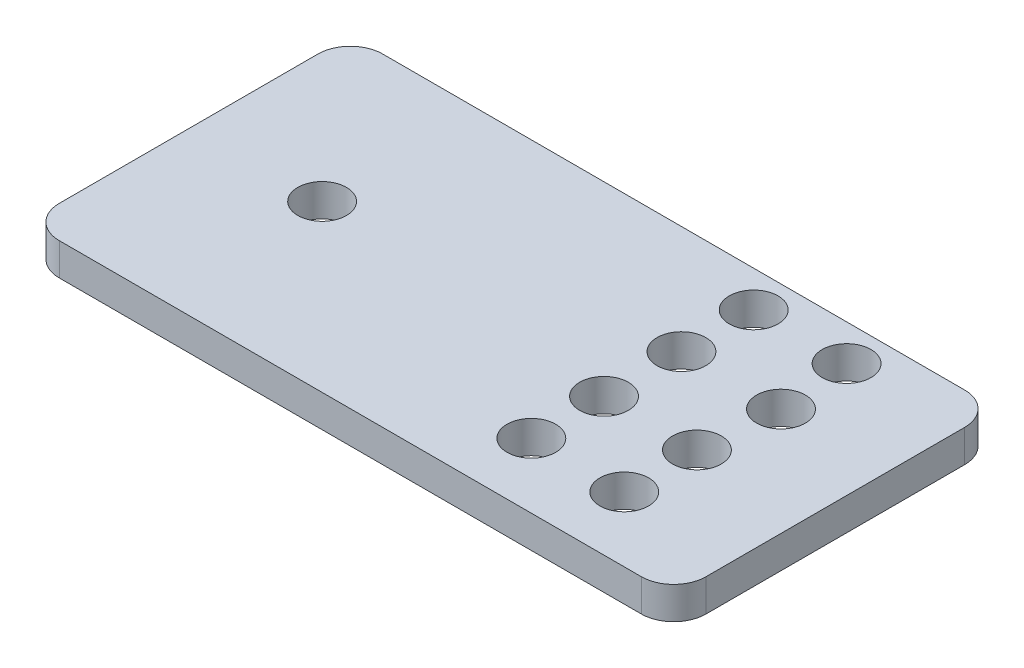
ISO-10303-21;
HEADER;
FILE_DESCRIPTION(('STEP AP214'),'2;1');
FILE_NAME('part.step','',(''),(''),'','','');
FILE_SCHEMA(('AUTOMOTIVE_DESIGN { 1 0 10303 214 1 1 1 1 }'));
ENDSEC;
DATA;
#1=APPLICATION_CONTEXT('core data for automotive mechanical design processes');
#2=APPLICATION_PROTOCOL_DEFINITION('international standard','automotive_design',2000,#1);
#3=PRODUCT_CONTEXT('',#1,'mechanical');
#4=PRODUCT('Part','Part','',(#3));
#5=PRODUCT_RELATED_PRODUCT_CATEGORY('part','',(#4));
#6=PRODUCT_DEFINITION_FORMATION('','',#4);
#7=PRODUCT_DEFINITION_CONTEXT('part definition',#1,'design');
#8=PRODUCT_DEFINITION('design','',#6,#7);
#9=PRODUCT_DEFINITION_SHAPE('','',#8);
#10=(LENGTH_UNIT() NAMED_UNIT(*) SI_UNIT(.MILLI.,.METRE.));
#11=(NAMED_UNIT(*) PLANE_ANGLE_UNIT() SI_UNIT($,.RADIAN.));
#12=(NAMED_UNIT(*) SI_UNIT($,.STERADIAN.) SOLID_ANGLE_UNIT());
#13=UNCERTAINTY_MEASURE_WITH_UNIT(LENGTH_MEASURE(1.E-05),#10,'distance_accuracy_value','');
#14=(GEOMETRIC_REPRESENTATION_CONTEXT(3) GLOBAL_UNCERTAINTY_ASSIGNED_CONTEXT((#13)) GLOBAL_UNIT_ASSIGNED_CONTEXT((#10,
#11,#12)) REPRESENTATION_CONTEXT('',''));
#15=CARTESIAN_POINT('',(0.,0.,0.));
#16=DIRECTION('',(0.,0.,1.));
#17=DIRECTION('',(1.,0.,0.));
#18=AXIS2_PLACEMENT_3D('',#15,#16,#17);
#19=CARTESIAN_POINT('',(73.5622211883193,10.,-38.8524590163934));
#20=DIRECTION('',(0.,-1.,0.));
#21=DIRECTION('',(0.,0.,-1.));
#22=AXIS2_PLACEMENT_3D('',#19,#20,#21);
#23=CYLINDRICAL_SURFACE('',#22,10.);
#24=CARTESIAN_POINT('',(73.5622211883193,0.,-38.8524590163934));
#25=DIRECTION('',(0.,1.,0.));
#26=DIRECTION('',(0.,0.,-1.));
#27=AXIS2_PLACEMENT_3D('',#24,#25,#26);
#28=CIRCLE('',#27,10.);
#29=CARTESIAN_POINT('',(83.5622211883193,0.,-38.8524590163934));
#30=VERTEX_POINT('',#29);
#31=CARTESIAN_POINT('',(73.5622211883193,0.,-48.8524590163935));
#32=VERTEX_POINT('',#31);
#33=EDGE_CURVE('E131',#30,#32,#28,.T.);
#34=ORIENTED_EDGE('',*,*,#33,.T.);
#35=DIRECTION('',(0.,-1.,0.));
#36=VECTOR('',#35,1.);
#37=CARTESIAN_POINT('',(73.5622211883193,10.,-48.8524590163935));
#38=LINE('',#37,#36);
#39=CARTESIAN_POINT('',(73.5622211883193,10.,-48.8524590163935));
#40=VERTEX_POINT('',#39);
#41=EDGE_CURVE('E11',#40,#32,#38,.T.);
#42=ORIENTED_EDGE('',*,*,#41,.F.);
#43=CARTESIAN_POINT('',(73.5622211883193,10.,-38.8524590163934));
#44=DIRECTION('',(0.,1.,0.));
#45=DIRECTION('',(0.,0.,-1.));
#46=AXIS2_PLACEMENT_3D('',#43,#44,#45);
#47=CIRCLE('',#46,10.);
#48=CARTESIAN_POINT('',(83.5622211883193,10.,-38.8524590163934));
#49=VERTEX_POINT('',#48);
#50=EDGE_CURVE('E146',#49,#40,#47,.T.);
#51=ORIENTED_EDGE('',*,*,#50,.F.);
#52=DIRECTION('',(0.,-1.,0.));
#53=VECTOR('',#52,1.);
#54=CARTESIAN_POINT('',(83.5622211883193,10.,-38.8524590163934));
#55=LINE('',#54,#53);
#56=EDGE_CURVE('E127',#49,#30,#55,.T.);
#57=ORIENTED_EDGE('',*,*,#56,.T.);
#58=EDGE_LOOP('',(#34,#42,#51,#57));
#59=FACE_BOUND('',#58,.T.);
#60=ADVANCED_FACE('F35',(#59),#23,.T.);
#61=CARTESIAN_POINT('',(73.5622211883193,10.,-48.8524590163935));
#62=DIRECTION('',(0.,0.,1.));
#63=DIRECTION('',(1.,0.,0.));
#64=AXIS2_PLACEMENT_3D('',#61,#62,#63);
#65=PLANE('',#64);
#66=DIRECTION('',(-1.,0.,0.));
#67=VECTOR('',#66,1.);
#68=CARTESIAN_POINT('',(73.5622211883193,0.,-48.8524590163935));
#69=LINE('',#68,#67);
#70=CARTESIAN_POINT('',(-106.437778811681,0.,-48.8524590163935));
#71=VERTEX_POINT('',#70);
#72=EDGE_CURVE('E134',#32,#71,#69,.T.);
#73=ORIENTED_EDGE('',*,*,#72,.T.);
#74=DIRECTION('',(0.,-1.,0.));
#75=VECTOR('',#74,1.);
#76=CARTESIAN_POINT('',(-106.437778811681,10.,-48.8524590163935));
#77=LINE('',#76,#75);
#78=CARTESIAN_POINT('',(-106.437778811681,10.,-48.8524590163935));
#79=VERTEX_POINT('',#78);
#80=EDGE_CURVE('E43',#79,#71,#77,.T.);
#81=ORIENTED_EDGE('',*,*,#80,.F.);
#82=DIRECTION('',(-1.,0.,0.));
#83=VECTOR('',#82,1.);
#84=CARTESIAN_POINT('',(73.5622211883193,10.,-48.8524590163935));
#85=LINE('',#84,#83);
#86=EDGE_CURVE('E94',#40,#79,#85,.T.);
#87=ORIENTED_EDGE('',*,*,#86,.F.);
#88=ORIENTED_EDGE('',*,*,#41,.T.);
#89=EDGE_LOOP('',(#73,#81,#87,#88));
#90=FACE_BOUND('',#89,.T.);
#91=ADVANCED_FACE('F264',(#90),#65,.F.);
#92=CARTESIAN_POINT('',(-106.437778811681,10.,-38.8524590163934));
#93=DIRECTION('',(0.,-1.,0.));
#94=DIRECTION('',(0.,0.,-1.));
#95=AXIS2_PLACEMENT_3D('',#92,#93,#94);
#96=CYLINDRICAL_SURFACE('',#95,10.);
#97=CARTESIAN_POINT('',(-106.437778811681,0.,-38.8524590163934));
#98=DIRECTION('',(0.,1.,0.));
#99=DIRECTION('',(0.,0.,1.));
#100=AXIS2_PLACEMENT_3D('',#97,#98,#99);
#101=CIRCLE('',#100,10.);
#102=CARTESIAN_POINT('',(-116.437778811681,0.,-38.8524590163934));
#103=VERTEX_POINT('',#102);
#104=EDGE_CURVE('E137',#71,#103,#101,.T.);
#105=ORIENTED_EDGE('',*,*,#104,.T.);
#106=DIRECTION('',(0.,-1.,0.));
#107=VECTOR('',#106,1.);
#108=CARTESIAN_POINT('',(-116.437778811681,10.,-38.8524590163934));
#109=LINE('',#108,#107);
#110=CARTESIAN_POINT('',(-116.437778811681,10.,-38.8524590163934));
#111=VERTEX_POINT('',#110);
#112=EDGE_CURVE('E153',#111,#103,#109,.T.);
#113=ORIENTED_EDGE('',*,*,#112,.F.);
#114=CARTESIAN_POINT('',(-106.437778811681,10.,-38.8524590163934));
#115=DIRECTION('',(0.,1.,0.));
#116=DIRECTION('',(0.,0.,1.));
#117=AXIS2_PLACEMENT_3D('',#114,#115,#116);
#118=CIRCLE('',#117,10.);
#119=EDGE_CURVE('E161',#79,#111,#118,.T.);
#120=ORIENTED_EDGE('',*,*,#119,.F.);
#121=ORIENTED_EDGE('',*,*,#80,.T.);
#122=EDGE_LOOP('',(#105,#113,#120,#121));
#123=FACE_BOUND('',#122,.T.);
#124=ADVANCED_FACE('F159',(#123),#96,.T.);
#125=CARTESIAN_POINT('',(-116.437778811681,10.,-38.8524590163934));
#126=DIRECTION('',(1.,0.,0.));
#127=DIRECTION('',(0.,0.,-1.));
#128=AXIS2_PLACEMENT_3D('',#125,#126,#127);
#129=PLANE('',#128);
#130=DIRECTION('',(0.,0.,1.));
#131=VECTOR('',#130,1.);
#132=CARTESIAN_POINT('',(-116.437778811681,0.,-38.8524590163934));
#133=LINE('',#132,#131);
#134=CARTESIAN_POINT('',(-116.437778811681,0.,41.1475409836065));
#135=VERTEX_POINT('',#134);
#136=EDGE_CURVE('E139',#103,#135,#133,.T.);
#137=ORIENTED_EDGE('',*,*,#136,.T.);
#138=DIRECTION('',(0.,-1.,0.));
#139=VECTOR('',#138,1.);
#140=CARTESIAN_POINT('',(-116.437778811681,10.,41.1475409836065));
#141=LINE('',#140,#139);
#142=CARTESIAN_POINT('',(-116.437778811681,10.,41.1475409836065));
#143=VERTEX_POINT('',#142);
#144=EDGE_CURVE('E150',#143,#135,#141,.T.);
#145=ORIENTED_EDGE('',*,*,#144,.F.);
#146=DIRECTION('',(0.,0.,1.));
#147=VECTOR('',#146,1.);
#148=CARTESIAN_POINT('',(-116.437778811681,10.,-38.8524590163934));
#149=LINE('',#148,#147);
#150=EDGE_CURVE('E173',#111,#143,#149,.T.);
#151=ORIENTED_EDGE('',*,*,#150,.F.);
#152=ORIENTED_EDGE('',*,*,#112,.T.);
#153=EDGE_LOOP('',(#137,#145,#151,#152));
#154=FACE_BOUND('',#153,.T.);
#155=ADVANCED_FACE('F169',(#154),#129,.F.);
#156=CARTESIAN_POINT('',(-106.437778811681,10.,41.1475409836066));
#157=DIRECTION('',(0.,-1.,0.));
#158=DIRECTION('',(0.,0.,-1.));
#159=AXIS2_PLACEMENT_3D('',#156,#157,#158);
#160=CYLINDRICAL_SURFACE('',#159,10.);
#161=CARTESIAN_POINT('',(-106.437778811681,0.,41.1475409836066));
#162=DIRECTION('',(0.,1.,0.));
#163=DIRECTION('',(0.,0.,1.));
#164=AXIS2_PLACEMENT_3D('',#161,#162,#163);
#165=CIRCLE('',#164,10.);
#166=CARTESIAN_POINT('',(-106.437778811681,0.,51.1475409836066));
#167=VERTEX_POINT('',#166);
#168=EDGE_CURVE('E141',#135,#167,#165,.T.);
#169=ORIENTED_EDGE('',*,*,#168,.T.);
#170=DIRECTION('',(0.,-1.,0.));
#171=VECTOR('',#170,1.);
#172=CARTESIAN_POINT('',(-106.437778811681,10.,51.1475409836066));
#173=LINE('',#172,#171);
#174=CARTESIAN_POINT('',(-106.437778811681,10.,51.1475409836066));
#175=VERTEX_POINT('',#174);
#176=EDGE_CURVE('E122',#175,#167,#173,.T.);
#177=ORIENTED_EDGE('',*,*,#176,.F.);
#178=CARTESIAN_POINT('',(-106.437778811681,10.,41.1475409836066));
#179=DIRECTION('',(0.,1.,0.));
#180=DIRECTION('',(0.,0.,1.));
#181=AXIS2_PLACEMENT_3D('',#178,#179,#180);
#182=CIRCLE('',#181,10.);
#183=EDGE_CURVE('E113',#143,#175,#182,.T.);
#184=ORIENTED_EDGE('',*,*,#183,.F.);
#185=ORIENTED_EDGE('',*,*,#144,.T.);
#186=EDGE_LOOP('',(#169,#177,#184,#185));
#187=FACE_BOUND('',#186,.T.);
#188=ADVANCED_FACE('F172',(#187),#160,.T.);
#189=CARTESIAN_POINT('',(73.5622211883193,10.,51.1475409836066));
#190=DIRECTION('',(0.,0.,-1.));
#191=DIRECTION('',(-1.,0.,0.));
#192=AXIS2_PLACEMENT_3D('',#189,#190,#191);
#193=PLANE('',#192);
#194=DIRECTION('',(1.,0.,0.));
#195=VECTOR('',#194,1.);
#196=CARTESIAN_POINT('',(73.5622211883193,0.,51.1475409836066));
#197=LINE('',#196,#195);
#198=CARTESIAN_POINT('',(73.5622211883193,0.,51.1475409836066));
#199=VERTEX_POINT('',#198);
#200=EDGE_CURVE('E121',#167,#199,#197,.T.);
#201=ORIENTED_EDGE('',*,*,#200,.T.);
#202=DIRECTION('',(0.,-1.,0.));
#203=VECTOR('',#202,1.);
#204=CARTESIAN_POINT('',(73.5622211883193,10.,51.1475409836066));
#205=LINE('',#204,#203);
#206=CARTESIAN_POINT('',(73.5622211883193,10.,51.1475409836066));
#207=VERTEX_POINT('',#206);
#208=EDGE_CURVE('E118',#207,#199,#205,.T.);
#209=ORIENTED_EDGE('',*,*,#208,.F.);
#210=DIRECTION('',(1.,0.,0.));
#211=VECTOR('',#210,1.);
#212=CARTESIAN_POINT('',(73.5622211883193,10.,51.1475409836066));
#213=LINE('',#212,#211);
#214=EDGE_CURVE('E107',#175,#207,#213,.T.);
#215=ORIENTED_EDGE('',*,*,#214,.F.);
#216=ORIENTED_EDGE('',*,*,#176,.T.);
#217=EDGE_LOOP('',(#201,#209,#215,#216));
#218=FACE_BOUND('',#217,.T.);
#219=ADVANCED_FACE('F119',(#218),#193,.F.);
#220=CARTESIAN_POINT('',(73.5622211883193,10.,41.1475409836066));
#221=DIRECTION('',(0.,-1.,0.));
#222=DIRECTION('',(0.,0.,-1.));
#223=AXIS2_PLACEMENT_3D('',#220,#221,#222);
#224=CYLINDRICAL_SURFACE('',#223,10.);
#225=CARTESIAN_POINT('',(73.5622211883193,0.,41.1475409836066));
#226=DIRECTION('',(0.,1.,0.));
#227=DIRECTION('',(0.,0.,-1.));
#228=AXIS2_PLACEMENT_3D('',#225,#226,#227);
#229=CIRCLE('',#228,10.);
#230=CARTESIAN_POINT('',(83.5622211883193,0.,41.1475409836065));
#231=VERTEX_POINT('',#230);
#232=EDGE_CURVE('E80',#199,#231,#229,.T.);
#233=ORIENTED_EDGE('',*,*,#232,.T.);
#234=DIRECTION('',(0.,-1.,0.));
#235=VECTOR('',#234,1.);
#236=CARTESIAN_POINT('',(83.5622211883193,10.,41.1475409836065));
#237=LINE('',#236,#235);
#238=CARTESIAN_POINT('',(83.5622211883193,10.,41.1475409836065));
#239=VERTEX_POINT('',#238);
#240=EDGE_CURVE('E123',#239,#231,#237,.T.);
#241=ORIENTED_EDGE('',*,*,#240,.F.);
#242=CARTESIAN_POINT('',(73.5622211883193,10.,41.1475409836066));
#243=DIRECTION('',(0.,1.,0.));
#244=DIRECTION('',(0.,0.,-1.));
#245=AXIS2_PLACEMENT_3D('',#242,#243,#244);
#246=CIRCLE('',#245,10.);
#247=EDGE_CURVE('E111',#207,#239,#246,.T.);
#248=ORIENTED_EDGE('',*,*,#247,.F.);
#249=ORIENTED_EDGE('',*,*,#208,.T.);
#250=EDGE_LOOP('',(#233,#241,#248,#249));
#251=FACE_BOUND('',#250,.T.);
#252=ADVANCED_FACE('F125',(#251),#224,.T.);
#253=CARTESIAN_POINT('',(83.5622211883193,10.,-38.8524590163934));
#254=DIRECTION('',(-1.,0.,0.));
#255=DIRECTION('',(0.,0.,1.));
#256=AXIS2_PLACEMENT_3D('',#253,#254,#255);
#257=PLANE('',#256);
#258=DIRECTION('',(0.,0.,-1.));
#259=VECTOR('',#258,1.);
#260=CARTESIAN_POINT('',(83.5622211883193,0.,-38.8524590163934));
#261=LINE('',#260,#259);
#262=EDGE_CURVE('E86',#231,#30,#261,.T.);
#263=ORIENTED_EDGE('',*,*,#262,.T.);
#264=ORIENTED_EDGE('',*,*,#56,.F.);
#265=DIRECTION('',(0.,0.,-1.));
#266=VECTOR('',#265,1.);
#267=CARTESIAN_POINT('',(83.5622211883193,10.,-38.8524590163934));
#268=LINE('',#267,#266);
#269=EDGE_CURVE('E51',#239,#49,#268,.T.);
#270=ORIENTED_EDGE('',*,*,#269,.F.);
#271=ORIENTED_EDGE('',*,*,#240,.T.);
#272=EDGE_LOOP('',(#263,#264,#270,#271));
#273=FACE_BOUND('',#272,.T.);
#274=ADVANCED_FACE('F238',(#273),#257,.F.);
#275=CARTESIAN_POINT('',(73.5622211883193,10.,-38.8524590163934));
#276=DIRECTION('',(0.,-1.,0.));
#277=DIRECTION('',(0.,0.,-1.));
#278=AXIS2_PLACEMENT_3D('',#275,#276,#277);
#279=PLANE('',#278);
#280=CARTESIAN_POINT('',(-76.3020489512749,10.,0.));
#281=DIRECTION('',(0.,1.,0.));
#282=DIRECTION('',(0.,0.,1.));
#283=AXIS2_PLACEMENT_3D('',#280,#281,#282);
#284=CIRCLE('',#283,7.53527543797673);
#285=CARTESIAN_POINT('',(-76.3020489512749,10.,7.53527543797673));
#286=VERTEX_POINT('',#285);
#287=EDGE_CURVE('E200',#286,#286,#284,.T.);
#288=ORIENTED_EDGE('',*,*,#287,.F.);
#289=EDGE_LOOP('',(#288));
#290=FACE_BOUND('',#289,.T.);
#291=CARTESIAN_POINT('',(19.4807832720758,10.,31.0796760534037));
#292=DIRECTION('',(0.,1.,0.));
#293=DIRECTION('',(0.,0.,1.));
#294=AXIS2_PLACEMENT_3D('',#291,#292,#293);
#295=CIRCLE('',#294,7.53527543797673);
#296=CARTESIAN_POINT('',(19.4807832720758,10.,38.6149514913805));
#297=VERTEX_POINT('',#296);
#298=EDGE_CURVE('E189',#297,#297,#295,.T.);
#299=ORIENTED_EDGE('',*,*,#298,.F.);
#300=EDGE_LOOP('',(#299));
#301=FACE_BOUND('',#300,.T.);
#302=CARTESIAN_POINT('',(48.215632939081,10.,31.0796760534037));
#303=DIRECTION('',(0.,1.,0.));
#304=DIRECTION('',(0.,0.,1.));
#305=AXIS2_PLACEMENT_3D('',#302,#303,#304);
#306=CIRCLE('',#305,7.53527543797673);
#307=CARTESIAN_POINT('',(48.215632939081,10.,38.6149514913805));
#308=VERTEX_POINT('',#307);
#309=EDGE_CURVE('E188',#308,#308,#306,.T.);
#310=ORIENTED_EDGE('',*,*,#309,.F.);
#311=EDGE_LOOP('',(#310));
#312=FACE_BOUND('',#311,.T.);
#313=CARTESIAN_POINT('',(19.4807832720758,10.,-37.6787142212159));
#314=DIRECTION('',(0.,1.,0.));
#315=DIRECTION('',(0.,0.,1.));
#316=AXIS2_PLACEMENT_3D('',#313,#314,#315);
#317=CIRCLE('',#316,7.53527543797673);
#318=CARTESIAN_POINT('',(19.4807832720758,10.,-30.1434387832392));
#319=VERTEX_POINT('',#318);
#320=EDGE_CURVE('E182',#319,#319,#317,.T.);
#321=ORIENTED_EDGE('',*,*,#320,.F.);
#322=EDGE_LOOP('',(#321));
#323=FACE_BOUND('',#322,.T.);
#324=CARTESIAN_POINT('',(19.4807832720758,10.,8.60691466479883));
#325=DIRECTION('',(0.,1.,0.));
#326=DIRECTION('',(0.,0.,1.));
#327=AXIS2_PLACEMENT_3D('',#324,#325,#326);
#328=CIRCLE('',#327,7.53527543797673);
#329=CARTESIAN_POINT('',(19.4807832720758,10.,16.1421901027756));
#330=VERTEX_POINT('',#329);
#331=EDGE_CURVE('E201',#330,#330,#328,.T.);
#332=ORIENTED_EDGE('',*,*,#331,.F.);
#333=EDGE_LOOP('',(#332));
#334=FACE_BOUND('',#333,.T.);
#335=CARTESIAN_POINT('',(48.215632939081,10.,8.60691466479883));
#336=DIRECTION('',(0.,1.,0.));
#337=DIRECTION('',(0.,0.,1.));
#338=AXIS2_PLACEMENT_3D('',#335,#336,#337);
#339=CIRCLE('',#338,7.53527543797673);
#340=CARTESIAN_POINT('',(48.215632939081,10.,16.1421901027756));
#341=VERTEX_POINT('',#340);
#342=EDGE_CURVE('E224',#341,#341,#339,.T.);
#343=ORIENTED_EDGE('',*,*,#342,.F.);
#344=EDGE_LOOP('',(#343));
#345=FACE_BOUND('',#344,.T.);
#346=CARTESIAN_POINT('',(19.4807832720758,10.,-15.3387933910389));
#347=DIRECTION('',(0.,1.,0.));
#348=DIRECTION('',(0.,0.,1.));
#349=AXIS2_PLACEMENT_3D('',#346,#347,#348);
#350=CIRCLE('',#349,7.53527543797673);
#351=CARTESIAN_POINT('',(19.4807832720758,10.,-7.80351795306213));
#352=VERTEX_POINT('',#351);
#353=EDGE_CURVE('E218',#352,#352,#350,.T.);
#354=ORIENTED_EDGE('',*,*,#353,.F.);
#355=EDGE_LOOP('',(#354));
#356=FACE_BOUND('',#355,.T.);
#357=CARTESIAN_POINT('',(50.26812220101,10.,-15.3387933910389));
#358=DIRECTION('',(0.,1.,0.));
#359=DIRECTION('',(0.,0.,1.));
#360=AXIS2_PLACEMENT_3D('',#357,#358,#359);
#361=CIRCLE('',#360,7.53527543797673);
#362=CARTESIAN_POINT('',(50.26812220101,10.,-7.80351795306213));
#363=VERTEX_POINT('',#362);
#364=EDGE_CURVE('E212',#363,#363,#361,.T.);
#365=ORIENTED_EDGE('',*,*,#364,.F.);
#366=EDGE_LOOP('',(#365));
#367=FACE_BOUND('',#366,.T.);
#368=CARTESIAN_POINT('',(48.215632939081,10.,-37.6787142212159));
#369=DIRECTION('',(0.,1.,0.));
#370=DIRECTION('',(0.,0.,1.));
#371=AXIS2_PLACEMENT_3D('',#368,#369,#370);
#372=CIRCLE('',#371,7.53527543797673);
#373=CARTESIAN_POINT('',(48.215632939081,10.,-30.1434387832392));
#374=VERTEX_POINT('',#373);
#375=EDGE_CURVE('E135',#374,#374,#372,.T.);
#376=ORIENTED_EDGE('',*,*,#375,.F.);
#377=EDGE_LOOP('',(#376));
#378=FACE_BOUND('',#377,.T.);
#379=ORIENTED_EDGE('',*,*,#50,.T.);
#380=ORIENTED_EDGE('',*,*,#86,.T.);
#381=ORIENTED_EDGE('',*,*,#119,.T.);
#382=ORIENTED_EDGE('',*,*,#150,.T.);
#383=ORIENTED_EDGE('',*,*,#183,.T.);
#384=ORIENTED_EDGE('',*,*,#214,.T.);
#385=ORIENTED_EDGE('',*,*,#247,.T.);
#386=ORIENTED_EDGE('',*,*,#269,.T.);
#387=EDGE_LOOP('',(#379,#380,#381,#382,#383,#384,#385,#386));
#388=FACE_BOUND('',#387,.T.);
#389=ADVANCED_FACE('F109',(#290,#301,#312,#323,#334,#345,#356,#367,#378,#388),#279,.F.);
#390=CARTESIAN_POINT('',(73.5622211883193,0.,-38.8524590163934));
#391=DIRECTION('',(0.,-1.,0.));
#392=DIRECTION('',(0.,0.,-1.));
#393=AXIS2_PLACEMENT_3D('',#390,#391,#392);
#394=PLANE('',#393);
#395=CARTESIAN_POINT('',(-76.3020489512749,0.,0.));
#396=DIRECTION('',(0.,1.,0.));
#397=DIRECTION('',(0.,0.,1.));
#398=AXIS2_PLACEMENT_3D('',#395,#396,#397);
#399=CIRCLE('',#398,7.53527543797673);
#400=CARTESIAN_POINT('',(-76.3020489512749,0.,7.53527543797673));
#401=VERTEX_POINT('',#400);
#402=EDGE_CURVE('E197',#401,#401,#399,.T.);
#403=ORIENTED_EDGE('',*,*,#402,.T.);
#404=EDGE_LOOP('',(#403));
#405=FACE_BOUND('',#404,.T.);
#406=CARTESIAN_POINT('',(19.4807832720758,0.,31.0796760534037));
#407=DIRECTION('',(0.,1.,0.));
#408=DIRECTION('',(0.,0.,1.));
#409=AXIS2_PLACEMENT_3D('',#406,#407,#408);
#410=CIRCLE('',#409,7.53527543797673);
#411=CARTESIAN_POINT('',(19.4807832720758,0.,38.6149514913805));
#412=VERTEX_POINT('',#411);
#413=EDGE_CURVE('E204',#412,#412,#410,.T.);
#414=ORIENTED_EDGE('',*,*,#413,.T.);
#415=EDGE_LOOP('',(#414));
#416=FACE_BOUND('',#415,.T.);
#417=CARTESIAN_POINT('',(48.215632939081,0.,31.0796760534037));
#418=DIRECTION('',(0.,1.,0.));
#419=DIRECTION('',(0.,0.,1.));
#420=AXIS2_PLACEMENT_3D('',#417,#418,#419);
#421=CIRCLE('',#420,7.53527543797673);
#422=CARTESIAN_POINT('',(48.215632939081,0.,38.6149514913805));
#423=VERTEX_POINT('',#422);
#424=EDGE_CURVE('E185',#423,#423,#421,.T.);
#425=ORIENTED_EDGE('',*,*,#424,.T.);
#426=EDGE_LOOP('',(#425));
#427=FACE_BOUND('',#426,.T.);
#428=CARTESIAN_POINT('',(19.4807832720758,0.,-37.6787142212159));
#429=DIRECTION('',(0.,1.,0.));
#430=DIRECTION('',(0.,0.,1.));
#431=AXIS2_PLACEMENT_3D('',#428,#429,#430);
#432=CIRCLE('',#431,7.53527543797673);
#433=CARTESIAN_POINT('',(19.4807832720758,0.,-30.1434387832392));
#434=VERTEX_POINT('',#433);
#435=EDGE_CURVE('E192',#434,#434,#432,.T.);
#436=ORIENTED_EDGE('',*,*,#435,.T.);
#437=EDGE_LOOP('',(#436));
#438=FACE_BOUND('',#437,.T.);
#439=CARTESIAN_POINT('',(19.4807832720758,0.,8.60691466479883));
#440=DIRECTION('',(0.,1.,0.));
#441=DIRECTION('',(0.,0.,1.));
#442=AXIS2_PLACEMENT_3D('',#439,#440,#441);
#443=CIRCLE('',#442,7.53527543797673);
#444=CARTESIAN_POINT('',(19.4807832720758,0.,16.1421901027756));
#445=VERTEX_POINT('',#444);
#446=EDGE_CURVE('E227',#445,#445,#443,.T.);
#447=ORIENTED_EDGE('',*,*,#446,.T.);
#448=EDGE_LOOP('',(#447));
#449=FACE_BOUND('',#448,.T.);
#450=CARTESIAN_POINT('',(48.215632939081,0.,8.60691466479883));
#451=DIRECTION('',(0.,1.,0.));
#452=DIRECTION('',(0.,0.,1.));
#453=AXIS2_PLACEMENT_3D('',#450,#451,#452);
#454=CIRCLE('',#453,7.53527543797673);
#455=CARTESIAN_POINT('',(48.215632939081,0.,16.1421901027756));
#456=VERTEX_POINT('',#455);
#457=EDGE_CURVE('E221',#456,#456,#454,.T.);
#458=ORIENTED_EDGE('',*,*,#457,.T.);
#459=EDGE_LOOP('',(#458));
#460=FACE_BOUND('',#459,.T.);
#461=CARTESIAN_POINT('',(19.4807832720758,0.,-15.3387933910389));
#462=DIRECTION('',(0.,1.,0.));
#463=DIRECTION('',(0.,0.,1.));
#464=AXIS2_PLACEMENT_3D('',#461,#462,#463);
#465=CIRCLE('',#464,7.53527543797673);
#466=CARTESIAN_POINT('',(19.4807832720758,0.,-7.80351795306213));
#467=VERTEX_POINT('',#466);
#468=EDGE_CURVE('E215',#467,#467,#465,.T.);
#469=ORIENTED_EDGE('',*,*,#468,.T.);
#470=EDGE_LOOP('',(#469));
#471=FACE_BOUND('',#470,.T.);
#472=CARTESIAN_POINT('',(50.26812220101,0.,-15.3387933910389));
#473=DIRECTION('',(0.,1.,0.));
#474=DIRECTION('',(0.,0.,1.));
#475=AXIS2_PLACEMENT_3D('',#472,#473,#474);
#476=CIRCLE('',#475,7.53527543797673);
#477=CARTESIAN_POINT('',(50.26812220101,0.,-7.80351795306213));
#478=VERTEX_POINT('',#477);
#479=EDGE_CURVE('E209',#478,#478,#476,.T.);
#480=ORIENTED_EDGE('',*,*,#479,.T.);
#481=EDGE_LOOP('',(#480));
#482=FACE_BOUND('',#481,.T.);
#483=CARTESIAN_POINT('',(48.215632939081,0.,-37.6787142212159));
#484=DIRECTION('',(0.,1.,0.));
#485=DIRECTION('',(0.,0.,1.));
#486=AXIS2_PLACEMENT_3D('',#483,#484,#485);
#487=CIRCLE('',#486,7.53527543797673);
#488=CARTESIAN_POINT('',(48.215632939081,0.,-30.1434387832392));
#489=VERTEX_POINT('',#488);
#490=EDGE_CURVE('E179',#489,#489,#487,.T.);
#491=ORIENTED_EDGE('',*,*,#490,.T.);
#492=EDGE_LOOP('',(#491));
#493=FACE_BOUND('',#492,.T.);
#494=ORIENTED_EDGE('',*,*,#33,.F.);
#495=ORIENTED_EDGE('',*,*,#262,.F.);
#496=ORIENTED_EDGE('',*,*,#232,.F.);
#497=ORIENTED_EDGE('',*,*,#200,.F.);
#498=ORIENTED_EDGE('',*,*,#168,.F.);
#499=ORIENTED_EDGE('',*,*,#136,.F.);
#500=ORIENTED_EDGE('',*,*,#104,.F.);
#501=ORIENTED_EDGE('',*,*,#72,.F.);
#502=EDGE_LOOP('',(#494,#495,#496,#497,#498,#499,#500,#501));
#503=FACE_BOUND('',#502,.T.);
#504=ADVANCED_FACE('F165',(#405,#416,#427,#438,#449,#460,#471,#482,#493,#503),#394,.T.);
#505=CARTESIAN_POINT('',(48.215632939081,10.,-37.6787142212159));
#506=DIRECTION('',(0.,-1.,0.));
#507=DIRECTION('',(0.,0.,-1.));
#508=AXIS2_PLACEMENT_3D('',#505,#506,#507);
#509=CYLINDRICAL_SURFACE('',#508,7.53527543797673);
#510=ORIENTED_EDGE('',*,*,#375,.T.);
#511=EDGE_LOOP('',(#510));
#512=FACE_BOUND('',#511,.T.);
#513=ORIENTED_EDGE('',*,*,#490,.F.);
#514=EDGE_LOOP('',(#513));
#515=FACE_BOUND('',#514,.T.);
#516=ADVANCED_FACE('F249',(#512,#515),#509,.F.);
#517=CARTESIAN_POINT('',(50.26812220101,10.,-15.3387933910389));
#518=DIRECTION('',(0.,-1.,0.));
#519=DIRECTION('',(0.,0.,-1.));
#520=AXIS2_PLACEMENT_3D('',#517,#518,#519);
#521=CYLINDRICAL_SURFACE('',#520,7.53527543797673);
#522=ORIENTED_EDGE('',*,*,#364,.T.);
#523=EDGE_LOOP('',(#522));
#524=FACE_BOUND('',#523,.T.);
#525=ORIENTED_EDGE('',*,*,#479,.F.);
#526=EDGE_LOOP('',(#525));
#527=FACE_BOUND('',#526,.T.);
#528=ADVANCED_FACE('F252',(#524,#527),#521,.F.);
#529=CARTESIAN_POINT('',(19.4807832720758,10.,-15.3387933910389));
#530=DIRECTION('',(0.,-1.,0.));
#531=DIRECTION('',(0.,0.,-1.));
#532=AXIS2_PLACEMENT_3D('',#529,#530,#531);
#533=CYLINDRICAL_SURFACE('',#532,7.53527543797673);
#534=ORIENTED_EDGE('',*,*,#353,.T.);
#535=EDGE_LOOP('',(#534));
#536=FACE_BOUND('',#535,.T.);
#537=ORIENTED_EDGE('',*,*,#468,.F.);
#538=EDGE_LOOP('',(#537));
#539=FACE_BOUND('',#538,.T.);
#540=ADVANCED_FACE('F333',(#536,#539),#533,.F.);
#541=CARTESIAN_POINT('',(48.215632939081,10.,8.60691466479883));
#542=DIRECTION('',(0.,-1.,0.));
#543=DIRECTION('',(0.,0.,-1.));
#544=AXIS2_PLACEMENT_3D('',#541,#542,#543);
#545=CYLINDRICAL_SURFACE('',#544,7.53527543797673);
#546=ORIENTED_EDGE('',*,*,#342,.T.);
#547=EDGE_LOOP('',(#546));
#548=FACE_BOUND('',#547,.T.);
#549=ORIENTED_EDGE('',*,*,#457,.F.);
#550=EDGE_LOOP('',(#549));
#551=FACE_BOUND('',#550,.T.);
#552=ADVANCED_FACE('F343',(#548,#551),#545,.F.);
#553=CARTESIAN_POINT('',(19.4807832720758,10.,8.60691466479883));
#554=DIRECTION('',(0.,-1.,0.));
#555=DIRECTION('',(0.,0.,-1.));
#556=AXIS2_PLACEMENT_3D('',#553,#554,#555);
#557=CYLINDRICAL_SURFACE('',#556,7.53527543797673);
#558=ORIENTED_EDGE('',*,*,#331,.T.);
#559=EDGE_LOOP('',(#558));
#560=FACE_BOUND('',#559,.T.);
#561=ORIENTED_EDGE('',*,*,#446,.F.);
#562=EDGE_LOOP('',(#561));
#563=FACE_BOUND('',#562,.T.);
#564=ADVANCED_FACE('F233',(#560,#563),#557,.F.);
#565=CARTESIAN_POINT('',(19.4807832720758,10.,-37.6787142212159));
#566=DIRECTION('',(0.,-1.,0.));
#567=DIRECTION('',(0.,0.,-1.));
#568=AXIS2_PLACEMENT_3D('',#565,#566,#567);
#569=CYLINDRICAL_SURFACE('',#568,7.53527543797673);
#570=ORIENTED_EDGE('',*,*,#320,.T.);
#571=EDGE_LOOP('',(#570));
#572=FACE_BOUND('',#571,.T.);
#573=ORIENTED_EDGE('',*,*,#435,.F.);
#574=EDGE_LOOP('',(#573));
#575=FACE_BOUND('',#574,.T.);
#576=ADVANCED_FACE('F362',(#572,#575),#569,.F.);
#577=CARTESIAN_POINT('',(48.215632939081,10.,31.0796760534037));
#578=DIRECTION('',(0.,-1.,0.));
#579=DIRECTION('',(0.,0.,-1.));
#580=AXIS2_PLACEMENT_3D('',#577,#578,#579);
#581=CYLINDRICAL_SURFACE('',#580,7.53527543797673);
#582=ORIENTED_EDGE('',*,*,#309,.T.);
#583=EDGE_LOOP('',(#582));
#584=FACE_BOUND('',#583,.T.);
#585=ORIENTED_EDGE('',*,*,#424,.F.);
#586=EDGE_LOOP('',(#585));
#587=FACE_BOUND('',#586,.T.);
#588=ADVANCED_FACE('F371',(#584,#587),#581,.F.);
#589=CARTESIAN_POINT('',(19.4807832720758,10.,31.0796760534037));
#590=DIRECTION('',(0.,-1.,0.));
#591=DIRECTION('',(0.,0.,-1.));
#592=AXIS2_PLACEMENT_3D('',#589,#590,#591);
#593=CYLINDRICAL_SURFACE('',#592,7.53527543797673);
#594=ORIENTED_EDGE('',*,*,#298,.T.);
#595=EDGE_LOOP('',(#594));
#596=FACE_BOUND('',#595,.T.);
#597=ORIENTED_EDGE('',*,*,#413,.F.);
#598=EDGE_LOOP('',(#597));
#599=FACE_BOUND('',#598,.T.);
#600=ADVANCED_FACE('F381',(#596,#599),#593,.F.);
#601=CARTESIAN_POINT('',(-76.3020489512749,10.,0.));
#602=DIRECTION('',(0.,-1.,0.));
#603=DIRECTION('',(0.,0.,-1.));
#604=AXIS2_PLACEMENT_3D('',#601,#602,#603);
#605=CYLINDRICAL_SURFACE('',#604,7.53527543797673);
#606=ORIENTED_EDGE('',*,*,#287,.T.);
#607=EDGE_LOOP('',(#606));
#608=FACE_BOUND('',#607,.T.);
#609=ORIENTED_EDGE('',*,*,#402,.F.);
#610=EDGE_LOOP('',(#609));
#611=FACE_BOUND('',#610,.T.);
#612=ADVANCED_FACE('F391',(#608,#611),#605,.F.);
#613=CLOSED_SHELL('',(#60,#91,#124,#155,#188,#219,#252,#274,#389,#504,#516,#528,#540,#552,#564,
#576,#588,#600,#612));
#614=MANIFOLD_SOLID_BREP('B2',#613);
#615=ADVANCED_BREP_SHAPE_REPRESENTATION('',(#18,#614),#14);
#616=SHAPE_DEFINITION_REPRESENTATION(#9,#615);
ENDSEC;
END-ISO-10303-21;
